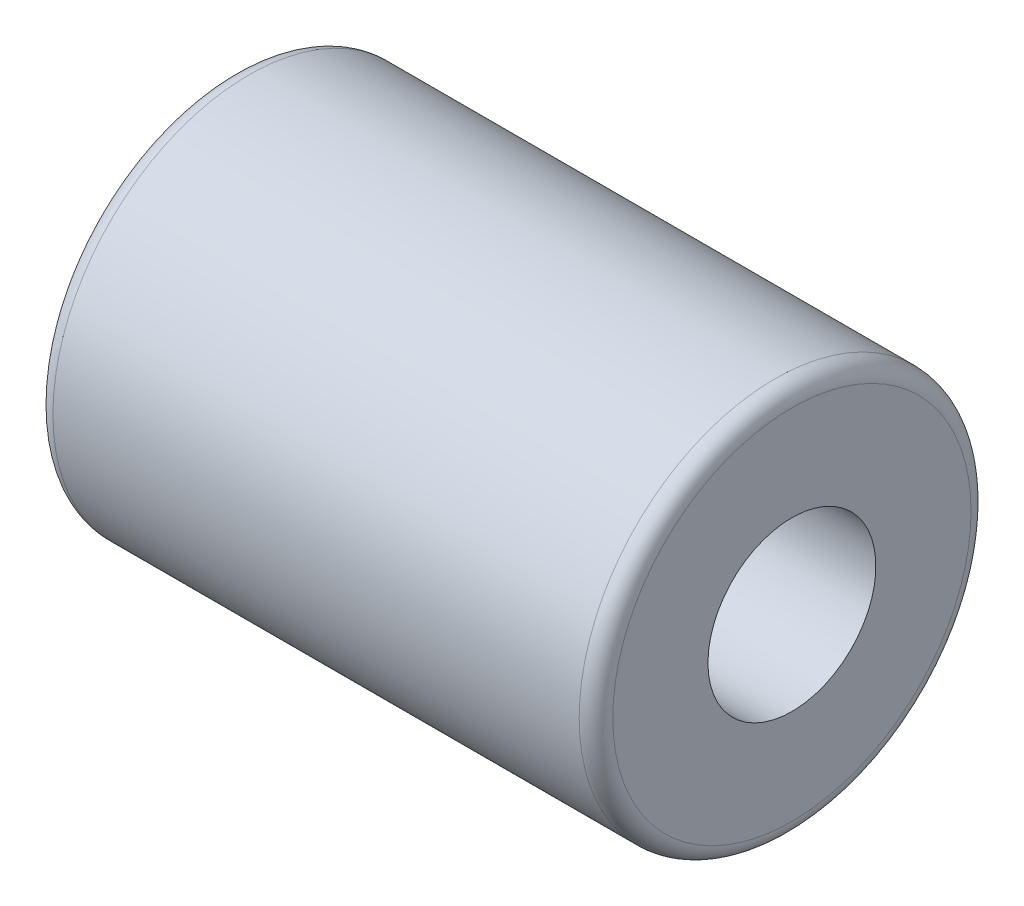
ISO-10303-21;
HEADER;
FILE_DESCRIPTION(('STEP AP214'),'2;1');
FILE_NAME('part.step','',(''),(''),'','','');
FILE_SCHEMA(('AUTOMOTIVE_DESIGN { 1 0 10303 214 1 1 1 1 }'));
ENDSEC;
DATA;
#1=APPLICATION_CONTEXT('core data for automotive mechanical design processes');
#2=APPLICATION_PROTOCOL_DEFINITION('international standard','automotive_design',2000,#1);
#3=PRODUCT_CONTEXT('',#1,'mechanical');
#4=PRODUCT('Part','Part','',(#3));
#5=PRODUCT_RELATED_PRODUCT_CATEGORY('part','',(#4));
#6=PRODUCT_DEFINITION_FORMATION('','',#4);
#7=PRODUCT_DEFINITION_CONTEXT('part definition',#1,'design');
#8=PRODUCT_DEFINITION('design','',#6,#7);
#9=PRODUCT_DEFINITION_SHAPE('','',#8);
#10=(LENGTH_UNIT() NAMED_UNIT(*) SI_UNIT(.MILLI.,.METRE.));
#11=(NAMED_UNIT(*) PLANE_ANGLE_UNIT() SI_UNIT($,.RADIAN.));
#12=(NAMED_UNIT(*) SI_UNIT($,.STERADIAN.) SOLID_ANGLE_UNIT());
#13=UNCERTAINTY_MEASURE_WITH_UNIT(LENGTH_MEASURE(1.E-05),#10,'distance_accuracy_value','');
#14=(GEOMETRIC_REPRESENTATION_CONTEXT(3) GLOBAL_UNCERTAINTY_ASSIGNED_CONTEXT((#13)) GLOBAL_UNIT_ASSIGNED_CONTEXT((#10,
#11,#12)) REPRESENTATION_CONTEXT('',''));
#15=CARTESIAN_POINT('',(0.,0.,0.));
#16=DIRECTION('',(0.,0.,1.));
#17=DIRECTION('',(1.,0.,0.));
#18=AXIS2_PLACEMENT_3D('',#15,#16,#17);
#19=CARTESIAN_POINT('',(10.,1.5,0.));
#20=DIRECTION('',(-1.,0.,0.));
#21=DIRECTION('',(0.,0.,1.));
#22=AXIS2_PLACEMENT_3D('',#19,#20,#21);
#23=PLANE('',#22);
#24=CARTESIAN_POINT('',(10.,0.,0.));
#25=DIRECTION('',(-1.,0.,0.));
#26=DIRECTION('',(0.,0.,1.));
#27=AXIS2_PLACEMENT_3D('',#24,#25,#26);
#28=CIRCLE('',#27,3.2);
#29=CARTESIAN_POINT('',(10.,0.,3.2));
#30=VERTEX_POINT('',#29);
#31=EDGE_CURVE('E10',#30,#30,#28,.F.);
#32=ORIENTED_EDGE('',*,*,#31,.T.);
#33=EDGE_LOOP('',(#32));
#34=FACE_BOUND('',#33,.T.);
#35=CARTESIAN_POINT('',(10.,0.,0.));
#36=DIRECTION('',(-1.,0.,0.));
#37=DIRECTION('',(0.,0.,1.));
#38=AXIS2_PLACEMENT_3D('',#35,#36,#37);
#39=CIRCLE('',#38,1.5);
#40=CARTESIAN_POINT('',(10.,0.,1.5));
#41=VERTEX_POINT('',#40);
#42=EDGE_CURVE('E57',#41,#41,#39,.T.);
#43=ORIENTED_EDGE('',*,*,#42,.T.);
#44=EDGE_LOOP('',(#43));
#45=FACE_BOUND('',#44,.T.);
#46=ADVANCED_FACE('F34',(#34,#45),#23,.F.);
#47=CARTESIAN_POINT('',(0.,0.,0.));
#48=DIRECTION('',(-1.,0.,0.));
#49=DIRECTION('',(0.,0.,1.));
#50=AXIS2_PLACEMENT_3D('',#47,#48,#49);
#51=CYLINDRICAL_SURFACE('',#50,3.5);
#52=CARTESIAN_POINT('',(0.3,0.,0.));
#53=DIRECTION('',(1.,0.,0.));
#54=DIRECTION('',(0.,0.,-1.));
#55=AXIS2_PLACEMENT_3D('',#52,#53,#54);
#56=CIRCLE('',#55,3.5);
#57=CARTESIAN_POINT('',(0.3,0.,-3.5));
#58=VERTEX_POINT('',#57);
#59=EDGE_CURVE('E41',#58,#58,#56,.T.);
#60=ORIENTED_EDGE('',*,*,#59,.T.);
#61=EDGE_LOOP('',(#60));
#62=FACE_BOUND('',#61,.T.);
#63=CARTESIAN_POINT('',(9.7,0.,0.));
#64=DIRECTION('',(-1.,0.,0.));
#65=DIRECTION('',(0.,0.,1.));
#66=AXIS2_PLACEMENT_3D('',#63,#64,#65);
#67=CIRCLE('',#66,3.5);
#68=CARTESIAN_POINT('',(9.7,0.,3.5));
#69=VERTEX_POINT('',#68);
#70=EDGE_CURVE('E45',#69,#69,#67,.T.);
#71=ORIENTED_EDGE('',*,*,#70,.T.);
#72=EDGE_LOOP('',(#71));
#73=FACE_BOUND('',#72,.T.);
#74=ADVANCED_FACE('F71',(#62,#73),#51,.T.);
#75=CARTESIAN_POINT('',(0.,1.5,0.));
#76=DIRECTION('',(1.,0.,0.));
#77=DIRECTION('',(0.,0.,-1.));
#78=AXIS2_PLACEMENT_3D('',#75,#76,#77);
#79=PLANE('',#78);
#80=CARTESIAN_POINT('',(0.,0.,0.));
#81=DIRECTION('',(1.,0.,0.));
#82=DIRECTION('',(0.,0.,-1.));
#83=AXIS2_PLACEMENT_3D('',#80,#81,#82);
#84=CIRCLE('',#83,3.2);
#85=CARTESIAN_POINT('',(0.,0.,-3.2));
#86=VERTEX_POINT('',#85);
#87=EDGE_CURVE('E49',#86,#86,#84,.F.);
#88=ORIENTED_EDGE('',*,*,#87,.T.);
#89=EDGE_LOOP('',(#88));
#90=FACE_BOUND('',#89,.T.);
#91=CARTESIAN_POINT('',(0.,0.,0.));
#92=DIRECTION('',(-1.,0.,0.));
#93=DIRECTION('',(0.,0.,1.));
#94=AXIS2_PLACEMENT_3D('',#91,#92,#93);
#95=CIRCLE('',#94,1.5);
#96=CARTESIAN_POINT('',(0.,0.,1.5));
#97=VERTEX_POINT('',#96);
#98=EDGE_CURVE('E54',#97,#97,#95,.T.);
#99=ORIENTED_EDGE('',*,*,#98,.F.);
#100=EDGE_LOOP('',(#99));
#101=FACE_BOUND('',#100,.T.);
#102=ADVANCED_FACE('F66',(#90,#101),#79,.F.);
#103=CARTESIAN_POINT('',(0.,0.,0.));
#104=DIRECTION('',(-1.,0.,0.));
#105=DIRECTION('',(0.,0.,1.));
#106=AXIS2_PLACEMENT_3D('',#103,#104,#105);
#107=CYLINDRICAL_SURFACE('',#106,1.5);
#108=ORIENTED_EDGE('',*,*,#42,.F.);
#109=EDGE_LOOP('',(#108));
#110=FACE_BOUND('',#109,.T.);
#111=ORIENTED_EDGE('',*,*,#98,.T.);
#112=EDGE_LOOP('',(#111));
#113=FACE_BOUND('',#112,.T.);
#114=ADVANCED_FACE('F62',(#110,#113),#107,.F.);
#115=CARTESIAN_POINT('',(0.3,0.,0.));
#116=DIRECTION('',(1.,0.,0.));
#117=DIRECTION('',(0.,0.,-1.));
#118=AXIS2_PLACEMENT_3D('',#115,#116,#117);
#119=TOROIDAL_SURFACE('',#118,3.2,0.3);
#120=ORIENTED_EDGE('',*,*,#59,.F.);
#121=EDGE_LOOP('',(#120));
#122=FACE_BOUND('',#121,.T.);
#123=ORIENTED_EDGE('',*,*,#87,.F.);
#124=EDGE_LOOP('',(#123));
#125=FACE_BOUND('',#124,.T.);
#126=ADVANCED_FACE('F65',(#122,#125),#119,.T.);
#127=CARTESIAN_POINT('',(9.7,0.,0.));
#128=DIRECTION('',(-1.,0.,0.));
#129=DIRECTION('',(0.,0.,1.));
#130=AXIS2_PLACEMENT_3D('',#127,#128,#129);
#131=TOROIDAL_SURFACE('',#130,3.2,0.3);
#132=ORIENTED_EDGE('',*,*,#31,.F.);
#133=EDGE_LOOP('',(#132));
#134=FACE_BOUND('',#133,.T.);
#135=ORIENTED_EDGE('',*,*,#70,.F.);
#136=EDGE_LOOP('',(#135));
#137=FACE_BOUND('',#136,.T.);
#138=ADVANCED_FACE('F36',(#134,#137),#131,.T.);
#139=CLOSED_SHELL('',(#46,#74,#102,#114,#126,#138));
#140=MANIFOLD_SOLID_BREP('B2',#139);
#141=ADVANCED_BREP_SHAPE_REPRESENTATION('',(#18,#140),#14);
#142=SHAPE_DEFINITION_REPRESENTATION(#9,#141);
ENDSEC;
END-ISO-10303-21;
